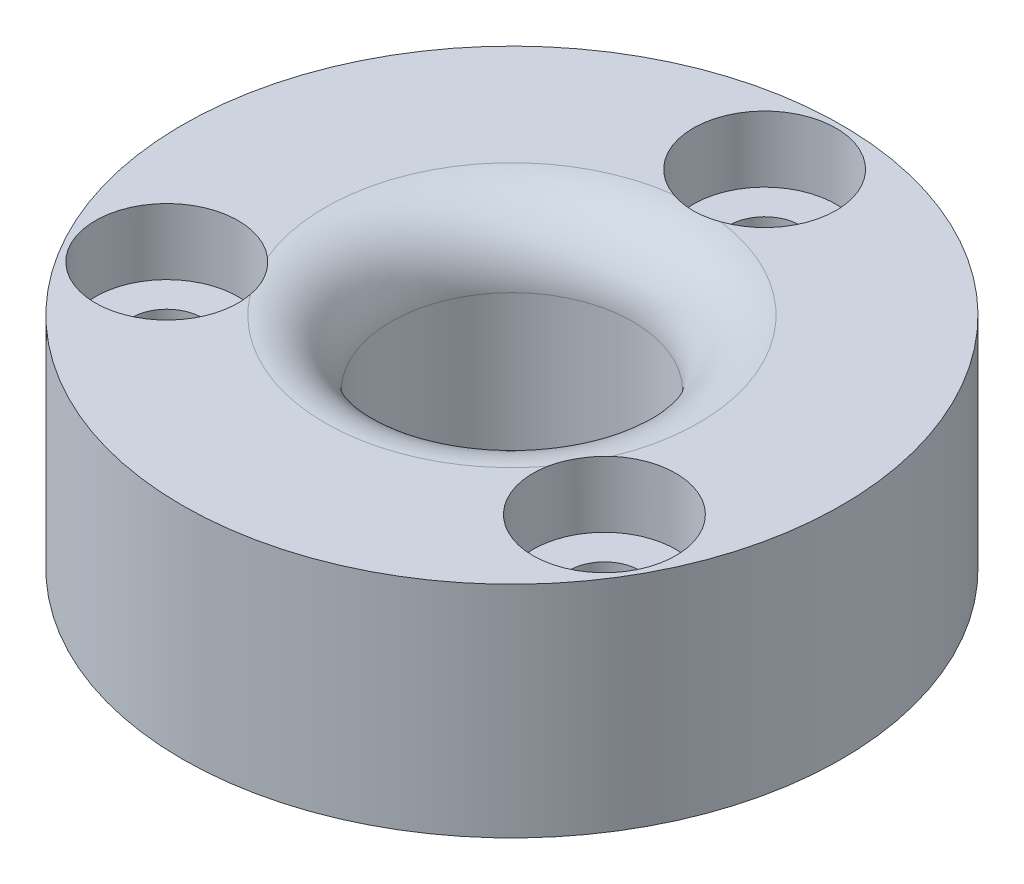
ISO-10303-21;
HEADER;
FILE_DESCRIPTION(('STEP AP214'),'2;1');
FILE_NAME('part.step','',(''),(''),'','','');
FILE_SCHEMA(('AUTOMOTIVE_DESIGN { 1 0 10303 214 1 1 1 1 }'));
ENDSEC;
DATA;
#1=APPLICATION_CONTEXT('core data for automotive mechanical design processes');
#2=APPLICATION_PROTOCOL_DEFINITION('international standard','automotive_design',2000,#1);
#3=PRODUCT_CONTEXT('',#1,'mechanical');
#4=PRODUCT('Part','Part','',(#3));
#5=PRODUCT_RELATED_PRODUCT_CATEGORY('part','',(#4));
#6=PRODUCT_DEFINITION_FORMATION('','',#4);
#7=PRODUCT_DEFINITION_CONTEXT('part definition',#1,'design');
#8=PRODUCT_DEFINITION('design','',#6,#7);
#9=PRODUCT_DEFINITION_SHAPE('','',#8);
#10=(LENGTH_UNIT() NAMED_UNIT(*) SI_UNIT(.MILLI.,.METRE.));
#11=(NAMED_UNIT(*) PLANE_ANGLE_UNIT() SI_UNIT($,.RADIAN.));
#12=(NAMED_UNIT(*) SI_UNIT($,.STERADIAN.) SOLID_ANGLE_UNIT());
#13=UNCERTAINTY_MEASURE_WITH_UNIT(LENGTH_MEASURE(1.E-05),#10,'distance_accuracy_value','');
#14=(GEOMETRIC_REPRESENTATION_CONTEXT(3) GLOBAL_UNCERTAINTY_ASSIGNED_CONTEXT((#13)) GLOBAL_UNIT_ASSIGNED_CONTEXT((#10,
#11,#12)) REPRESENTATION_CONTEXT('',''));
#15=CARTESIAN_POINT('',(0.,0.,0.));
#16=DIRECTION('',(0.,0.,1.));
#17=DIRECTION('',(1.,0.,0.));
#18=AXIS2_PLACEMENT_3D('',#15,#16,#17);
#19=CARTESIAN_POINT('',(0.,10.,0.));
#20=DIRECTION('',(0.,1.,0.));
#21=DIRECTION('',(0.,0.,1.));
#22=AXIS2_PLACEMENT_3D('',#19,#20,#21);
#23=PLANE('',#22);
#24=CARTESIAN_POINT('',(-9.9592921435211,10.,5.74999999999991));
#25=DIRECTION('',(0.,1.,0.));
#26=DIRECTION('',(0.,0.,1.));
#27=AXIS2_PLACEMENT_3D('',#24,#25,#26);
#28=CIRCLE('',#27,3.25);
#29=CARTESIAN_POINT('',(-7.83863732788528,10.,3.28721232077934));
#30=VERTEX_POINT('',#29);
#31=CARTESIAN_POINT('',(-6.76612804137085,10.,5.14485289661183));
#32=VERTEX_POINT('',#31);
#33=EDGE_CURVE('E49',#30,#32,#28,.T.);
#34=ORIENTED_EDGE('',*,*,#33,.F.);
#35=CARTESIAN_POINT('',(0.,10.,0.));
#36=DIRECTION('',(0.,1.,0.));
#37=DIRECTION('',(0.,0.,1.));
#38=AXIS2_PLACEMENT_3D('',#35,#36,#37);
#39=CIRCLE('',#38,8.5);
#40=CARTESIAN_POINT('',(-1.07250928651445,10.,-8.4320652173913));
#41=VERTEX_POINT('',#40);
#42=EDGE_CURVE('E76',#30,#41,#39,.F.);
#43=ORIENTED_EDGE('',*,*,#42,.T.);
#44=CARTESIAN_POINT('',(0.,10.,-11.5));
#45=DIRECTION('',(0.,1.,0.));
#46=DIRECTION('',(0.,0.,1.));
#47=AXIS2_PLACEMENT_3D('',#44,#45,#46);
#48=CIRCLE('',#47,3.25);
#49=CARTESIAN_POINT('',(1.07250928651444,10.,-8.4320652173913));
#50=VERTEX_POINT('',#49);
#51=EDGE_CURVE('E153',#50,#41,#48,.T.);
#52=ORIENTED_EDGE('',*,*,#51,.F.);
#53=CARTESIAN_POINT('',(7.83863732788523,10.,3.28721232077945));
#54=VERTEX_POINT('',#53);
#55=EDGE_CURVE('E87',#50,#54,#39,.F.);
#56=ORIENTED_EDGE('',*,*,#55,.T.);
#57=CARTESIAN_POINT('',(9.95929214352102,10.,5.75000000000005));
#58=DIRECTION('',(0.,1.,0.));
#59=DIRECTION('',(0.,0.,1.));
#60=AXIS2_PLACEMENT_3D('',#57,#58,#59);
#61=CIRCLE('',#60,3.25);
#62=CARTESIAN_POINT('',(6.76612804137078,10.,5.14485289661192));
#63=VERTEX_POINT('',#62);
#64=EDGE_CURVE('E56',#63,#54,#61,.T.);
#65=ORIENTED_EDGE('',*,*,#64,.F.);
#66=EDGE_CURVE('E78',#63,#32,#39,.F.);
#67=ORIENTED_EDGE('',*,*,#66,.T.);
#68=EDGE_LOOP('',(#34,#43,#52,#56,#65,#67));
#69=FACE_BOUND('',#68,.T.);
#70=CARTESIAN_POINT('',(0.,10.,0.));
#71=DIRECTION('',(0.,1.,0.));
#72=DIRECTION('',(0.,0.,1.));
#73=AXIS2_PLACEMENT_3D('',#70,#71,#72);
#74=CIRCLE('',#73,15.);
#75=CARTESIAN_POINT('',(0.,10.,15.));
#76=VERTEX_POINT('',#75);
#77=EDGE_CURVE('E89',#76,#76,#74,.T.);
#78=ORIENTED_EDGE('',*,*,#77,.T.);
#79=EDGE_LOOP('',(#78));
#80=FACE_BOUND('',#79,.T.);
#81=ADVANCED_FACE('F31',(#69,#80),#23,.T.);
#82=CARTESIAN_POINT('',(0.,0.,0.));
#83=DIRECTION('',(0.,1.,0.));
#84=DIRECTION('',(0.,0.,1.));
#85=AXIS2_PLACEMENT_3D('',#82,#83,#84);
#86=PLANE('',#85);
#87=CARTESIAN_POINT('',(-9.9592921435211,0.,5.74999999999991));
#88=DIRECTION('',(0.,1.,0.));
#89=DIRECTION('',(0.,0.,1.));
#90=AXIS2_PLACEMENT_3D('',#87,#88,#89);
#91=CIRCLE('',#90,1.6);
#92=CARTESIAN_POINT('',(-9.9592921435211,0.,7.34999999999991));
#93=VERTEX_POINT('',#92);
#94=EDGE_CURVE('E165',#93,#93,#91,.T.);
#95=ORIENTED_EDGE('',*,*,#94,.T.);
#96=EDGE_LOOP('',(#95));
#97=FACE_BOUND('',#96,.T.);
#98=CARTESIAN_POINT('',(9.95929214352102,0.,5.75000000000005));
#99=DIRECTION('',(0.,1.,0.));
#100=DIRECTION('',(0.,0.,1.));
#101=AXIS2_PLACEMENT_3D('',#98,#99,#100);
#102=CIRCLE('',#101,1.6);
#103=CARTESIAN_POINT('',(9.95929214352102,0.,7.35000000000004));
#104=VERTEX_POINT('',#103);
#105=EDGE_CURVE('E155',#104,#104,#102,.T.);
#106=ORIENTED_EDGE('',*,*,#105,.T.);
#107=EDGE_LOOP('',(#106));
#108=FACE_BOUND('',#107,.T.);
#109=CARTESIAN_POINT('',(0.,0.,-11.5));
#110=DIRECTION('',(0.,1.,0.));
#111=DIRECTION('',(0.,0.,1.));
#112=AXIS2_PLACEMENT_3D('',#109,#110,#111);
#113=CIRCLE('',#112,1.6);
#114=CARTESIAN_POINT('',(0.,0.,-9.9));
#115=VERTEX_POINT('',#114);
#116=EDGE_CURVE('E142',#115,#115,#113,.T.);
#117=ORIENTED_EDGE('',*,*,#116,.T.);
#118=EDGE_LOOP('',(#117));
#119=FACE_BOUND('',#118,.T.);
#120=CARTESIAN_POINT('',(0.,0.,0.));
#121=DIRECTION('',(0.,1.,0.));
#122=DIRECTION('',(0.,0.,1.));
#123=AXIS2_PLACEMENT_3D('',#120,#121,#122);
#124=CIRCLE('',#123,15.);
#125=CARTESIAN_POINT('',(0.,0.,15.));
#126=VERTEX_POINT('',#125);
#127=EDGE_CURVE('E136',#126,#126,#124,.T.);
#128=ORIENTED_EDGE('',*,*,#127,.F.);
#129=EDGE_LOOP('',(#128));
#130=FACE_BOUND('',#129,.T.);
#131=CARTESIAN_POINT('',(0.,0.,0.));
#132=DIRECTION('',(0.,1.,0.));
#133=DIRECTION('',(0.,0.,1.));
#134=AXIS2_PLACEMENT_3D('',#131,#132,#133);
#135=CIRCLE('',#134,5.5);
#136=CARTESIAN_POINT('',(0.,0.,5.5));
#137=VERTEX_POINT('',#136);
#138=EDGE_CURVE('E138',#137,#137,#135,.T.);
#139=ORIENTED_EDGE('',*,*,#138,.T.);
#140=EDGE_LOOP('',(#139));
#141=FACE_BOUND('',#140,.T.);
#142=ADVANCED_FACE('F124',(#97,#108,#119,#130,#141),#86,.F.);
#143=CARTESIAN_POINT('',(0.,10.,0.));
#144=DIRECTION('',(0.,-1.,0.));
#145=DIRECTION('',(0.,0.,-1.));
#146=AXIS2_PLACEMENT_3D('',#143,#144,#145);
#147=CYLINDRICAL_SURFACE('',#146,15.);
#148=ORIENTED_EDGE('',*,*,#77,.F.);
#149=EDGE_LOOP('',(#148));
#150=FACE_BOUND('',#149,.T.);
#151=ORIENTED_EDGE('',*,*,#127,.T.);
#152=EDGE_LOOP('',(#151));
#153=FACE_BOUND('',#152,.T.);
#154=ADVANCED_FACE('F120',(#150,#153),#147,.T.);
#155=CARTESIAN_POINT('',(0.,10.,0.));
#156=DIRECTION('',(0.,-1.,0.));
#157=DIRECTION('',(0.,0.,-1.));
#158=AXIS2_PLACEMENT_3D('',#155,#156,#157);
#159=CYLINDRICAL_SURFACE('',#158,5.5);
#160=CARTESIAN_POINT('',(0.,7.,0.));
#161=DIRECTION('',(0.,1.,0.));
#162=DIRECTION('',(0.,0.,1.));
#163=AXIS2_PLACEMENT_3D('',#160,#161,#162);
#164=CIRCLE('',#163,5.5);
#165=CARTESIAN_POINT('',(0.,7.,5.5));
#166=VERTEX_POINT('',#165);
#167=EDGE_CURVE('E85',#166,#166,#164,.T.);
#168=ORIENTED_EDGE('',*,*,#167,.T.);
#169=EDGE_LOOP('',(#168));
#170=FACE_BOUND('',#169,.T.);
#171=ORIENTED_EDGE('',*,*,#138,.F.);
#172=EDGE_LOOP('',(#171));
#173=FACE_BOUND('',#172,.T.);
#174=ADVANCED_FACE('F117',(#170,#173),#159,.F.);
#175=CARTESIAN_POINT('',(0.,7.,0.));
#176=DIRECTION('',(0.,1.,0.));
#177=DIRECTION('',(0.,0.,1.));
#178=AXIS2_PLACEMENT_3D('',#175,#176,#177);
#179=TOROIDAL_SURFACE('',#178,8.5,3.);
#180=CARTESIAN_POINT('',(-7.9528843064547,6.9998,8.30672204030045));
#181=CARTESIAN_POINT('',(-7.95291349526285,7.08402581447586,8.30671370165396));
#182=CARTESIAN_POINT('',(-7.95007514137053,7.16824598802199,8.30451678499896));
#183=CARTESIAN_POINT('',(-7.9388470334106,7.33606769910124,8.29566196173626));
#184=CARTESIAN_POINT('',(-7.93045809296209,7.41966932548672,8.28900470893416));
#185=CARTESIAN_POINT('',(-7.90831539710904,7.58564914515512,8.27114784473851));
#186=CARTESIAN_POINT('',(-7.89456309521475,7.66802766363562,8.25994946399122));
#187=CARTESIAN_POINT('',(-7.86206083571598,7.830986179441,8.23285395670866));
#188=CARTESIAN_POINT('',(-7.84331079606662,7.91156614721661,8.21695675303515));
#189=CARTESIAN_POINT('',(-7.78021147342289,8.14980675284658,8.16190318608751));
#190=CARTESIAN_POINT('',(-7.72899861777641,8.3040696854439,8.11537456509393));
#191=CARTESIAN_POINT('',(-7.61317893137215,8.5989599307288,8.00052202839465));
#192=CARTESIAN_POINT('',(-7.54857117692763,8.739586302083,7.93219660944811));
#193=CARTESIAN_POINT('',(-7.44702370161229,8.9360547158919,7.81244901396246));
#194=CARTESIAN_POINT('',(-7.41262519527217,8.99879323942691,7.76996663357835));
#195=CARTESIAN_POINT('',(-7.34308771610125,9.11933982179076,7.67905339194318));
#196=CARTESIAN_POINT('',(-7.30794913586295,9.17715041651798,7.63062562186706));
#197=CARTESIAN_POINT('',(-7.23795156020502,9.2872653026427,7.52782637851456));
#198=CARTESIAN_POINT('',(-7.20309229206419,9.3395757869535,7.47346173369903));
#199=CARTESIAN_POINT('',(-7.13466819495623,9.4382850429451,7.35886563861767));
#200=CARTESIAN_POINT('',(-7.10110312645166,9.48468491229229,7.29863528135614));
#201=CARTESIAN_POINT('',(-7.04037210858462,9.56581728292658,7.18047334851702));
#202=CARTESIAN_POINT('',(-7.01292928859125,9.60128313343428,7.12318625216844));
#203=CARTESIAN_POINT('',(-6.96056860880243,9.66724161201334,7.00473075969318));
#204=CARTESIAN_POINT('',(-6.93565047336746,9.69773478321295,6.94356278846026));
#205=CARTESIAN_POINT('',(-6.88899725552192,9.75371372104959,6.81783881851576));
#206=CARTESIAN_POINT('',(-6.86726120486234,9.77920101169241,6.7532838585571));
#207=CARTESIAN_POINT('',(-6.82752370407116,9.82530255034079,6.62136845606787));
#208=CARTESIAN_POINT('',(-6.80952215734153,9.8459169243929,6.55400808615718));
#209=CARTESIAN_POINT('',(-6.76475064387514,9.89746016158016,6.36124207245122));
#210=CARTESIAN_POINT('',(-6.74278153277365,9.92311402331387,6.23324692534144));
#211=CARTESIAN_POINT('',(-6.71437174394372,9.96193529613793,5.97379575404397));
#212=CARTESIAN_POINT('',(-6.7079379084366,9.97509720383264,5.84233823067497));
#213=CARTESIAN_POINT('',(-6.71128949112293,9.99354470818284,5.56518001738695));
#214=CARTESIAN_POINT('',(-6.72285916219729,9.99785194254633,5.41944098980464));
#215=CARTESIAN_POINT('',(-6.76549794954097,10.0008602647851,5.13072823653447));
#216=CARTESIAN_POINT('',(-6.79658003133189,9.99955762165805,4.98775641475443));
#217=CARTESIAN_POINT('',(-6.86131442934674,9.99650557745164,4.76376349756135));
#218=CARTESIAN_POINT('',(-6.88891479400108,9.99514605383957,4.68093481645125));
#219=CARTESIAN_POINT('',(-6.95069737871887,9.9926669755401,4.5177399061888));
#220=CARTESIAN_POINT('',(-6.98488025600601,9.99154744483815,4.43737392385138));
#221=CARTESIAN_POINT('',(-7.05962208790884,9.98999927711195,4.27961308138166));
#222=CARTESIAN_POINT('',(-7.10018406459625,9.98957096863995,4.20221965121623));
#223=CARTESIAN_POINT('',(-7.18740540003452,9.98955952313569,4.05095154054525));
#224=CARTESIAN_POINT('',(-7.23406457047353,9.98997636000686,3.97707675146256));
#225=CARTESIAN_POINT('',(-7.33538244683644,9.99154014693691,3.83012680907962));
#226=CARTESIAN_POINT('',(-7.39030478138598,9.99271876990088,3.75723361855655));
#227=CARTESIAN_POINT('',(-7.50609003290785,9.9953260810628,3.61631355845324));
#228=CARTESIAN_POINT('',(-7.56695403017995,9.99675481477292,3.54828757772897));
#229=CARTESIAN_POINT('',(-7.69409481751981,9.99905155671689,3.41768952257643));
#230=CARTESIAN_POINT('',(-7.76036306739044,9.9999204310541,3.35510915414842));
#231=CARTESIAN_POINT('',(-7.89792057594519,10.0000692095836,3.23573221885974));
#232=CARTESIAN_POINT('',(-7.96920953440801,9.99934920870733,3.17893530666396));
#233=CARTESIAN_POINT('',(-8.11512538204657,9.99516792835697,3.07239493919838));
#234=CARTESIAN_POINT('',(-8.1896830925997,9.99174946774793,3.02255550209644));
#235=CARTESIAN_POINT('',(-8.34240570170597,9.98103284776865,2.9293233523175));
#236=CARTESIAN_POINT('',(-8.42056901153314,9.97373638252002,2.88592783517137));
#237=CARTESIAN_POINT('',(-8.50019999999998,9.96390456382002,2.84594247358709));
#238=B_SPLINE_CURVE_WITH_KNOTS('',3,(#180,#181,#182,#183,#184,#185,#186,#187,#188,#189,#190,
#191,#192,#193,#194,#195,#196,#197,#198,#199,#200,#201,#202,#203,#204,#205,#206,#207,#208,#209,
#210,#211,#212,#213,#214,#215,#216,#217,#218,#219,#220,#221,#222,#223,#224,#225,#226,#227,#228,
#229,#230,#231,#232,#233,#234,#235,#236,#237),.UNSPECIFIED.,.F.,.F.,(4,2,2,2,2,2,2,2,2,2,2,2,2,
2,2,2,2,2,2,2,2,2,2,2,2,2,2,2,4),(0.,0.252590645413552,0.50514427364828,0.757629505507321,
1.01011888252083,1.51479220113866,2.01950033265028,2.26883513598035,2.51804084784135,
2.76696288907398,3.01583863513332,3.23378640681183,3.4517103577327,3.66956786001971,
3.88741972642268,4.28271536230798,4.67818506702533,5.11541083072167,5.55292742824733,
5.8146301738745,6.07635906248265,6.33821231965671,6.60005749140201,6.87355791291988,
7.14710815461414,7.42023419113195,7.6933439094855,7.96220500432064,8.23094874255015),.UNSPECIFIED.);
#239=EDGE_CURVE('E11',#32,#30,#238,.T.);
#240=ORIENTED_EDGE('',*,*,#239,.F.);
#241=ORIENTED_EDGE('',*,*,#66,.F.);
#242=CARTESIAN_POINT('',(8.50019999999998,9.96390456382002,2.84594247358718));
#243=CARTESIAN_POINT('',(8.42173753619034,9.9735923289353,2.88534184087229));
#244=CARTESIAN_POINT('',(8.34469770294567,9.9808184718064,2.92805239304136));
#245=CARTESIAN_POINT('',(8.19421674118654,9.99148251409981,3.01966592861263));
#246=CARTESIAN_POINT('',(8.12077198715863,9.99492430838189,3.06856248744171));
#247=CARTESIAN_POINT('',(7.97818899879202,9.99916637981736,3.17211456971734));
#248=CARTESIAN_POINT('',(7.90904379710831,9.99997104594068,3.22676036806794));
#249=CARTESIAN_POINT('',(7.77540410265338,10.0000274620042,3.34149662837243));
#250=CARTESIAN_POINT('',(7.71091077652495,9.99927882378315,3.40158844766521));
#251=CARTESIAN_POINT('',(7.58718585215632,9.99717732835309,3.52664014006052));
#252=CARTESIAN_POINT('',(7.52794093176847,9.99582605675911,3.59158686833544));
#253=CARTESIAN_POINT('',(7.41490891471146,9.99326851064967,3.72606130797377));
#254=CARTESIAN_POINT('',(7.36112134427885,9.99206222354614,3.7955886208217));
#255=CARTESIAN_POINT('',(7.25935002770574,9.99029472354664,3.93877736359713));
#256=CARTESIAN_POINT('',(7.21136626612181,9.98973350893414,4.01243878252338));
#257=CARTESIAN_POINT('',(7.12152123544998,9.98946305532764,4.16340848019144));
#258=CARTESIAN_POINT('',(7.07966011227065,9.98975383663408,4.24071684578559));
#259=CARTESIAN_POINT('',(7.00088643580881,9.99110773683156,4.40142972564351));
#260=CARTESIAN_POINT('',(6.96421881474291,9.992199455262,4.48495414848876));
#261=CARTESIAN_POINT('',(6.89803035200987,9.99472638758616,4.65479058758731));
#262=CARTESIAN_POINT('',(6.86851016941583,9.99616163313265,4.74110286008018));
#263=CARTESIAN_POINT('',(6.8168189867444,9.99860783917294,4.91592929590922));
#264=CARTESIAN_POINT('',(6.79464973761743,9.99961869859561,5.00444397845707));
#265=CARTESIAN_POINT('',(6.75782528613532,10.000208709166,5.18305731783589));
#266=CARTESIAN_POINT('',(6.74317164852948,9.99978756230937,5.2731563004826));
#267=CARTESIAN_POINT('',(6.72318140342031,9.99660889283633,5.44013373528673));
#268=CARTESIAN_POINT('',(6.71675027109132,9.99422488873636,5.51688919214607));
#269=CARTESIAN_POINT('',(6.70935407766485,9.98684543665114,5.67053401421045));
#270=CARTESIAN_POINT('',(6.70838796359088,9.98185049193343,5.74742335076406));
#271=CARTESIAN_POINT('',(6.7118847564607,9.96849930797437,5.90072112434539));
#272=CARTESIAN_POINT('',(6.71634248028595,9.96014628288045,5.97712995046311));
#273=CARTESIAN_POINT('',(6.73055237018286,9.93936977230032,6.12886991656355));
#274=CARTESIAN_POINT('',(6.74030212587759,9.92694814097452,6.2042015311668));
#275=CARTESIAN_POINT('',(6.76496245477866,9.89727643429431,6.35378276864675));
#276=CARTESIAN_POINT('',(6.77991869861136,9.87998389708888,6.42801654537974));
#277=CARTESIAN_POINT('',(6.81457082962285,9.84012242220368,6.57392402659497));
#278=CARTESIAN_POINT('',(6.83426671218845,9.81755348965952,6.6455977335689));
#279=CARTESIAN_POINT('',(6.87783203454523,9.76682786252629,6.78560325034162));
#280=CARTESIAN_POINT('',(6.9017000864792,9.73867302564917,6.85393616180144));
#281=CARTESIAN_POINT('',(6.95289316107712,9.67667881874037,6.98657930958359));
#282=CARTESIAN_POINT('',(6.98021781239212,9.6428400592153,7.05088997691567));
#283=CARTESIAN_POINT('',(7.05819101746025,9.54307731361486,7.21965495775354));
#284=CARTESIAN_POINT('',(7.1114717402677,9.47158976238951,7.31968733646038));
#285=CARTESIAN_POINT('',(7.22141529886311,9.31329480590755,7.50446463055144));
#286=CARTESIAN_POINT('',(7.27807901641828,9.22648339489552,7.58920553690459));
#287=CARTESIAN_POINT('',(7.39244004105435,9.03633976877036,7.74587239760544));
#288=CARTESIAN_POINT('',(7.4501045311073,8.93253717248042,7.81724871389131));
#289=CARTESIAN_POINT('',(7.56025828639663,8.7131562216913,7.94413158185851));
#290=CARTESIAN_POINT('',(7.61274458801859,8.59757119985463,7.9996290797984));
#291=CARTESIAN_POINT('',(7.71563015161197,8.34042766764881,8.10255183452084));
#292=CARTESIAN_POINT('',(7.76474424300262,8.19748516416334,8.14780960105173));
#293=CARTESIAN_POINT('',(7.84747643691627,7.90297780937124,8.22099235307312));
#294=CARTESIAN_POINT('',(7.88110045757691,7.75141627595709,8.24892395961324));
#295=CARTESIAN_POINT('',(7.92115183265754,7.49911168447723,8.28157759725591));
#296=CARTESIAN_POINT('',(7.93301609372297,7.39979145498406,8.29103907164748));
#297=CARTESIAN_POINT('',(7.94890020919315,7.20026081829488,8.30359651649869));
#298=CARTESIAN_POINT('',(7.95293045080356,7.10005176704942,8.30670091616072));
#299=CARTESIAN_POINT('',(7.95288430645459,6.9998,8.30672204030055));
#300=B_SPLINE_CURVE_WITH_KNOTS('',3,(#242,#243,#244,#245,#246,#247,#248,#249,#250,#251,#252,
#253,#254,#255,#256,#257,#258,#259,#260,#261,#262,#263,#264,#265,#266,#267,#268,#269,#270,#271,
#272,#273,#274,#275,#276,#277,#278,#279,#280,#281,#282,#283,#284,#285,#286,#287,#288,#289,#290,
#291,#292,#293,#294,#295,#296,#297,#298,#299),.UNSPECIFIED.,.F.,.F.,(4,2,2,2,2,2,2,2,2,2,2,2,2,
2,2,2,2,2,2,2,2,2,2,2,2,2,2,2,4),(0.,0.264809077706108,0.529345357480958,0.793441145592838,
1.05760293758444,1.3210737453752,1.58452166113382,1.84796887586577,2.11142236778508,
2.38477143982544,2.65814570809136,2.9315850458505,3.20508129055633,3.43604569353222,
3.66696559375303,3.89766499590931,4.12825940881404,4.36092977270088,4.59359991012567,
4.82619279743908,5.058760718051,5.45871861001187,5.85878120878548,6.27278849453911,
6.68703136955496,7.15837999631516,7.62954838992798,7.93049125860065,8.23103483116235),.UNSPECIFIED.);
#301=EDGE_CURVE('E44',#54,#63,#300,.T.);
#302=ORIENTED_EDGE('',*,*,#301,.F.);
#303=ORIENTED_EDGE('',*,*,#55,.F.);
#304=CARTESIAN_POINT('',(-1.25047989188152,9.99859856255483,-8.5002));
#305=CARTESIAN_POINT('',(-1.16636553239915,10.0000030183212,-8.46512571639273));
#306=CARTESIAN_POINT('',(-1.08077038799964,10.0002295300003,-8.43360833209235));
#307=CARTESIAN_POINT('',(-0.907247436811413,9.99934582324657,-8.37787123641145));
#308=CARTESIAN_POINT('',(-0.819319812552102,9.99823570911208,-8.35365095581464));
#309=CARTESIAN_POINT('',(-0.641717187752954,9.99569737683255,-8.31267942158227));
#310=CARTESIAN_POINT('',(-0.552041601109505,9.99426905025424,-8.29593071979786));
#311=CARTESIAN_POINT('',(-0.371598377811345,9.99182156916942,-8.27002784502525));
#312=CARTESIAN_POINT('',(-0.280830802799068,9.99080239167715,-8.26087324537397));
#313=CARTESIAN_POINT('',(-0.0987824331815704,9.98960051767584,-8.2502213157281));
#314=CARTESIAN_POINT('',(-0.0075013447922989,9.98941836221901,-8.24872893853177));
#315=CARTESIAN_POINT('',(0.174873354647932,9.98996245583605,-8.25342629490181));
#316=CARTESIAN_POINT('',(0.265966937281877,9.99068883371392,-8.2596171177249));
#317=CARTESIAN_POINT('',(0.447133095673133,9.99275659860493,-8.27961757407847));
#318=CARTESIAN_POINT('',(0.537207247516346,9.99409684627624,-8.29341310289249));
#319=CARTESIAN_POINT('',(0.71584425783307,9.99677093971868,-8.32851023339412));
#320=CARTESIAN_POINT('',(0.804407811166893,9.99810478821868,-8.34980828072251));
#321=CARTESIAN_POINT('',(0.952871732766194,9.99960583938183,-8.39217844853683));
#322=CARTESIAN_POINT('',(1.01331601634157,10.000004220722,-8.41135855532825));
#323=CARTESIAN_POINT('',(1.13290259981809,9.99999575430475,-8.45319153030782));
#324=CARTESIAN_POINT('',(1.19204647206559,9.99958993998091,-8.47583990707759));
#325=CARTESIAN_POINT('',(1.25047989188155,9.99859856255483,-8.50020000000002));
#326=B_SPLINE_CURVE_WITH_KNOTS('',3,(#304,#305,#306,#307,#308,#309,#310,#311,#312,#313,#314,
#315,#316,#317,#318,#319,#320,#321,#322,#323,#324,#325),.UNSPECIFIED.,.F.,.F.,(4,2,2,2,2,2,2,2,
2,2,4),(0.,0.273319321183288,0.546617316354809,0.820008582689274,1.09338448791053,
1.36693707886561,1.64052845613839,1.91361409290788,2.18657052747393,2.37671108947819,
2.56660746935892),.UNSPECIFIED.);
#327=EDGE_CURVE('E84',#41,#50,#326,.T.);
#328=ORIENTED_EDGE('',*,*,#327,.F.);
#329=ORIENTED_EDGE('',*,*,#42,.F.);
#330=EDGE_LOOP('',(#240,#241,#302,#303,#328,#329));
#331=FACE_BOUND('',#330,.T.);
#332=ORIENTED_EDGE('',*,*,#167,.F.);
#333=EDGE_LOOP('',(#332));
#334=FACE_BOUND('',#333,.T.);
#335=ADVANCED_FACE('F33',(#331,#334),#179,.T.);
#336=CARTESIAN_POINT('',(0.,10.,-11.5));
#337=DIRECTION('',(0.,1.,0.));
#338=DIRECTION('',(0.,0.,1.));
#339=AXIS2_PLACEMENT_3D('',#336,#337,#338);
#340=CYLINDRICAL_SURFACE('',#339,1.6);
#341=ORIENTED_EDGE('',*,*,#116,.F.);
#342=EDGE_LOOP('',(#341));
#343=FACE_BOUND('',#342,.T.);
#344=CARTESIAN_POINT('',(0.,7.,-11.5));
#345=DIRECTION('',(0.,1.,0.));
#346=DIRECTION('',(0.,0.,1.));
#347=AXIS2_PLACEMENT_3D('',#344,#345,#346);
#348=CIRCLE('',#347,1.6);
#349=CARTESIAN_POINT('',(0.,7.,-9.9));
#350=VERTEX_POINT('',#349);
#351=EDGE_CURVE('E147',#350,#350,#348,.T.);
#352=ORIENTED_EDGE('',*,*,#351,.T.);
#353=EDGE_LOOP('',(#352));
#354=FACE_BOUND('',#353,.T.);
#355=ADVANCED_FACE('F112',(#343,#354),#340,.F.);
#356=CARTESIAN_POINT('',(1.6,7.,-11.5));
#357=DIRECTION('',(0.,-1.,0.));
#358=DIRECTION('',(0.,0.,-1.));
#359=AXIS2_PLACEMENT_3D('',#356,#357,#358);
#360=PLANE('',#359);
#361=ORIENTED_EDGE('',*,*,#351,.F.);
#362=EDGE_LOOP('',(#361));
#363=FACE_BOUND('',#362,.T.);
#364=CARTESIAN_POINT('',(0.,7.,-11.5));
#365=DIRECTION('',(0.,1.,0.));
#366=DIRECTION('',(0.,0.,1.));
#367=AXIS2_PLACEMENT_3D('',#364,#365,#366);
#368=CIRCLE('',#367,3.25);
#369=CARTESIAN_POINT('',(0.,7.,-8.25));
#370=VERTEX_POINT('',#369);
#371=EDGE_CURVE('E150',#370,#370,#368,.T.);
#372=ORIENTED_EDGE('',*,*,#371,.T.);
#373=EDGE_LOOP('',(#372));
#374=FACE_BOUND('',#373,.T.);
#375=ADVANCED_FACE('F108',(#363,#374),#360,.F.);
#376=CARTESIAN_POINT('',(0.,10.,-11.5));
#377=DIRECTION('',(0.,1.,0.));
#378=DIRECTION('',(0.,0.,1.));
#379=AXIS2_PLACEMENT_3D('',#376,#377,#378);
#380=CYLINDRICAL_SURFACE('',#379,3.25);
#381=ORIENTED_EDGE('',*,*,#327,.T.);
#382=ORIENTED_EDGE('',*,*,#51,.T.);
#383=EDGE_LOOP('',(#381,#382));
#384=FACE_BOUND('',#383,.T.);
#385=ORIENTED_EDGE('',*,*,#371,.F.);
#386=EDGE_LOOP('',(#385));
#387=FACE_BOUND('',#386,.T.);
#388=ADVANCED_FACE('F102',(#384,#387),#380,.F.);
#389=CARTESIAN_POINT('',(9.95929214352102,10.,5.75000000000005));
#390=DIRECTION('',(0.,1.,0.));
#391=DIRECTION('',(0.,0.,1.));
#392=AXIS2_PLACEMENT_3D('',#389,#390,#391);
#393=CYLINDRICAL_SURFACE('',#392,1.6);
#394=ORIENTED_EDGE('',*,*,#105,.F.);
#395=EDGE_LOOP('',(#394));
#396=FACE_BOUND('',#395,.T.);
#397=CARTESIAN_POINT('',(9.95929214352102,7.,5.75000000000005));
#398=DIRECTION('',(0.,1.,0.));
#399=DIRECTION('',(0.,0.,1.));
#400=AXIS2_PLACEMENT_3D('',#397,#398,#399);
#401=CIRCLE('',#400,1.6);
#402=CARTESIAN_POINT('',(9.95929214352102,7.,7.35000000000005));
#403=VERTEX_POINT('',#402);
#404=EDGE_CURVE('E158',#403,#403,#401,.T.);
#405=ORIENTED_EDGE('',*,*,#404,.T.);
#406=EDGE_LOOP('',(#405));
#407=FACE_BOUND('',#406,.T.);
#408=ADVANCED_FACE('F107',(#396,#407),#393,.F.);
#409=CARTESIAN_POINT('',(11.559292143521,7.,5.75000000000005));
#410=DIRECTION('',(0.,-1.,0.));
#411=DIRECTION('',(0.,0.,-1.));
#412=AXIS2_PLACEMENT_3D('',#409,#410,#411);
#413=PLANE('',#412);
#414=ORIENTED_EDGE('',*,*,#404,.F.);
#415=EDGE_LOOP('',(#414));
#416=FACE_BOUND('',#415,.T.);
#417=CARTESIAN_POINT('',(9.95929214352102,7.,5.75000000000005));
#418=DIRECTION('',(0.,1.,0.));
#419=DIRECTION('',(0.,0.,1.));
#420=AXIS2_PLACEMENT_3D('',#417,#418,#419);
#421=CIRCLE('',#420,3.25);
#422=CARTESIAN_POINT('',(9.95929214352102,7.,9.00000000000005));
#423=VERTEX_POINT('',#422);
#424=EDGE_CURVE('E161',#423,#423,#421,.T.);
#425=ORIENTED_EDGE('',*,*,#424,.T.);
#426=EDGE_LOOP('',(#425));
#427=FACE_BOUND('',#426,.T.);
#428=ADVANCED_FACE('F189',(#416,#427),#413,.F.);
#429=CARTESIAN_POINT('',(9.95929214352102,10.,5.75000000000005));
#430=DIRECTION('',(0.,1.,0.));
#431=DIRECTION('',(0.,0.,1.));
#432=AXIS2_PLACEMENT_3D('',#429,#430,#431);
#433=CYLINDRICAL_SURFACE('',#432,3.25);
#434=ORIENTED_EDGE('',*,*,#301,.T.);
#435=ORIENTED_EDGE('',*,*,#64,.T.);
#436=EDGE_LOOP('',(#434,#435));
#437=FACE_BOUND('',#436,.T.);
#438=ORIENTED_EDGE('',*,*,#424,.F.);
#439=EDGE_LOOP('',(#438));
#440=FACE_BOUND('',#439,.T.);
#441=ADVANCED_FACE('F185',(#437,#440),#433,.F.);
#442=CARTESIAN_POINT('',(-9.9592921435211,10.,5.74999999999991));
#443=DIRECTION('',(0.,1.,0.));
#444=DIRECTION('',(0.,0.,1.));
#445=AXIS2_PLACEMENT_3D('',#442,#443,#444);
#446=CYLINDRICAL_SURFACE('',#445,1.6);
#447=ORIENTED_EDGE('',*,*,#94,.F.);
#448=EDGE_LOOP('',(#447));
#449=FACE_BOUND('',#448,.T.);
#450=CARTESIAN_POINT('',(-9.9592921435211,7.,5.74999999999991));
#451=DIRECTION('',(0.,1.,0.));
#452=DIRECTION('',(0.,0.,1.));
#453=AXIS2_PLACEMENT_3D('',#450,#451,#452);
#454=CIRCLE('',#453,1.6);
#455=CARTESIAN_POINT('',(-9.9592921435211,7.,7.34999999999991));
#456=VERTEX_POINT('',#455);
#457=EDGE_CURVE('E168',#456,#456,#454,.T.);
#458=ORIENTED_EDGE('',*,*,#457,.T.);
#459=EDGE_LOOP('',(#458));
#460=FACE_BOUND('',#459,.T.);
#461=ADVANCED_FACE('F179',(#449,#460),#446,.F.);
#462=CARTESIAN_POINT('',(-8.35929214352109,7.,5.74999999999991));
#463=DIRECTION('',(0.,-1.,0.));
#464=DIRECTION('',(0.,0.,-1.));
#465=AXIS2_PLACEMENT_3D('',#462,#463,#464);
#466=PLANE('',#465);
#467=ORIENTED_EDGE('',*,*,#457,.F.);
#468=EDGE_LOOP('',(#467));
#469=FACE_BOUND('',#468,.T.);
#470=CARTESIAN_POINT('',(-9.9592921435211,7.,5.74999999999991));
#471=DIRECTION('',(0.,1.,0.));
#472=DIRECTION('',(0.,0.,1.));
#473=AXIS2_PLACEMENT_3D('',#470,#471,#472);
#474=CIRCLE('',#473,3.25);
#475=CARTESIAN_POINT('',(-9.9592921435211,7.,8.99999999999991));
#476=VERTEX_POINT('',#475);
#477=EDGE_CURVE('E79',#476,#476,#474,.T.);
#478=ORIENTED_EDGE('',*,*,#477,.T.);
#479=EDGE_LOOP('',(#478));
#480=FACE_BOUND('',#479,.T.);
#481=ADVANCED_FACE('F174',(#469,#480),#466,.F.);
#482=CARTESIAN_POINT('',(-9.9592921435211,10.,5.74999999999991));
#483=DIRECTION('',(0.,1.,0.));
#484=DIRECTION('',(0.,0.,1.));
#485=AXIS2_PLACEMENT_3D('',#482,#483,#484);
#486=CYLINDRICAL_SURFACE('',#485,3.25);
#487=ORIENTED_EDGE('',*,*,#239,.T.);
#488=ORIENTED_EDGE('',*,*,#33,.T.);
#489=EDGE_LOOP('',(#487,#488));
#490=FACE_BOUND('',#489,.T.);
#491=ORIENTED_EDGE('',*,*,#477,.F.);
#492=EDGE_LOOP('',(#491));
#493=FACE_BOUND('',#492,.T.);
#494=ADVANCED_FACE('F67',(#490,#493),#486,.F.);
#495=CLOSED_SHELL('',(#81,#142,#154,#174,#335,#355,#375,#388,#408,#428,#441,#461,#481,#494));
#496=MANIFOLD_SOLID_BREP('B2',#495);
#497=ADVANCED_BREP_SHAPE_REPRESENTATION('',(#18,#496),#14);
#498=SHAPE_DEFINITION_REPRESENTATION(#9,#497);
ENDSEC;
END-ISO-10303-21;
